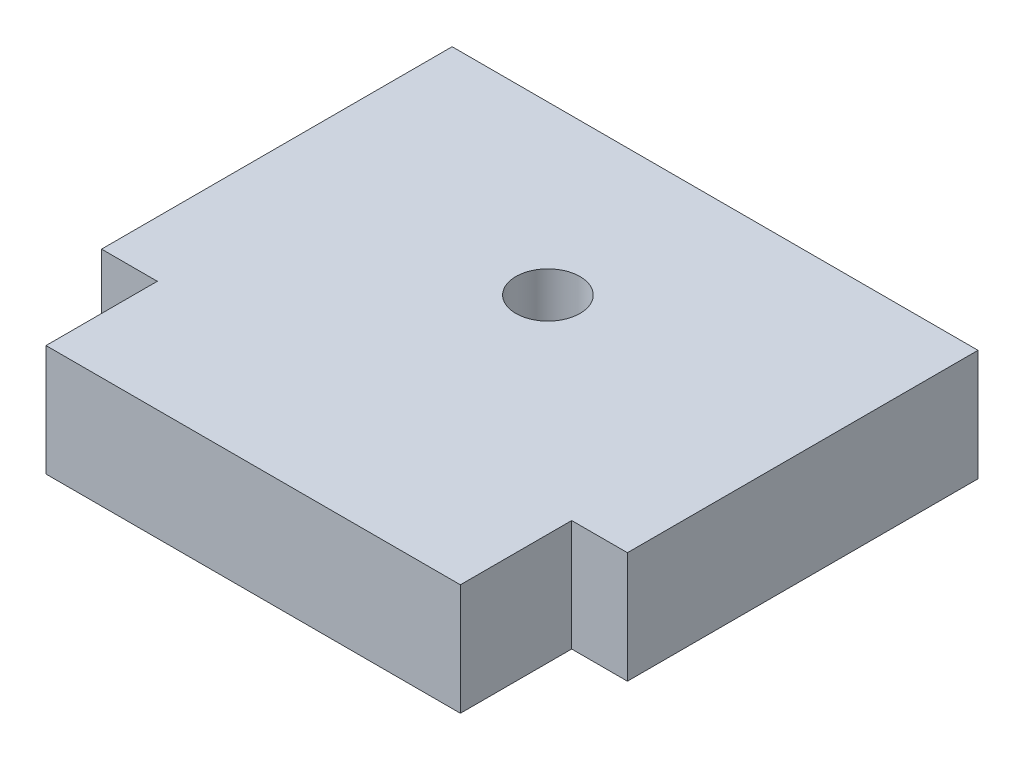
ISO-10303-21;
HEADER;
FILE_DESCRIPTION(('STEP AP214'),'2;1');
FILE_NAME('part.step','',(''),(''),'','','');
FILE_SCHEMA(('AUTOMOTIVE_DESIGN { 1 0 10303 214 1 1 1 1 }'));
ENDSEC;
DATA;
#1=APPLICATION_CONTEXT('core data for automotive mechanical design processes');
#2=APPLICATION_PROTOCOL_DEFINITION('international standard','automotive_design',2000,#1);
#3=PRODUCT_CONTEXT('',#1,'mechanical');
#4=PRODUCT('Part','Part','',(#3));
#5=PRODUCT_RELATED_PRODUCT_CATEGORY('part','',(#4));
#6=PRODUCT_DEFINITION_FORMATION('','',#4);
#7=PRODUCT_DEFINITION_CONTEXT('part definition',#1,'design');
#8=PRODUCT_DEFINITION('design','',#6,#7);
#9=PRODUCT_DEFINITION_SHAPE('','',#8);
#10=(LENGTH_UNIT() NAMED_UNIT(*) SI_UNIT(.MILLI.,.METRE.));
#11=(NAMED_UNIT(*) PLANE_ANGLE_UNIT() SI_UNIT($,.RADIAN.));
#12=(NAMED_UNIT(*) SI_UNIT($,.STERADIAN.) SOLID_ANGLE_UNIT());
#13=UNCERTAINTY_MEASURE_WITH_UNIT(LENGTH_MEASURE(1.E-05),#10,'distance_accuracy_value','');
#14=(GEOMETRIC_REPRESENTATION_CONTEXT(3) GLOBAL_UNCERTAINTY_ASSIGNED_CONTEXT((#13)) GLOBAL_UNIT_ASSIGNED_CONTEXT((#10,
#11,#12)) REPRESENTATION_CONTEXT('',''));
#15=CARTESIAN_POINT('',(0.,0.,0.));
#16=DIRECTION('',(0.,0.,1.));
#17=DIRECTION('',(1.,0.,0.));
#18=AXIS2_PLACEMENT_3D('',#15,#16,#17);
#19=CARTESIAN_POINT('',(-15.,6.35,10.));
#20=DIRECTION('',(0.,0.,-1.));
#21=DIRECTION('',(-1.,0.,0.));
#22=AXIS2_PLACEMENT_3D('',#19,#20,#21);
#23=PLANE('',#22);
#24=DIRECTION('',(1.,0.,0.));
#25=VECTOR('',#24,1.);
#26=CARTESIAN_POINT('',(-15.,0.,10.));
#27=LINE('',#26,#25);
#28=CARTESIAN_POINT('',(-15.,0.,10.));
#29=VERTEX_POINT('',#28);
#30=CARTESIAN_POINT('',(-11.82,0.,10.));
#31=VERTEX_POINT('',#30);
#32=EDGE_CURVE('E129',#29,#31,#27,.T.);
#33=ORIENTED_EDGE('',*,*,#32,.T.);
#34=DIRECTION('',(0.,-1.,0.));
#35=VECTOR('',#34,1.);
#36=CARTESIAN_POINT('',(-11.82,6.35,10.));
#37=LINE('',#36,#35);
#38=CARTESIAN_POINT('',(-11.82,6.35,10.));
#39=VERTEX_POINT('',#38);
#40=EDGE_CURVE('E11',#39,#31,#37,.T.);
#41=ORIENTED_EDGE('',*,*,#40,.F.);
#42=DIRECTION('',(1.,0.,0.));
#43=VECTOR('',#42,1.);
#44=CARTESIAN_POINT('',(-15.,6.35,10.));
#45=LINE('',#44,#43);
#46=CARTESIAN_POINT('',(-15.,6.35,10.));
#47=VERTEX_POINT('',#46);
#48=EDGE_CURVE('E144',#47,#39,#45,.T.);
#49=ORIENTED_EDGE('',*,*,#48,.F.);
#50=DIRECTION('',(0.,-1.,0.));
#51=VECTOR('',#50,1.);
#52=CARTESIAN_POINT('',(-15.,6.35,10.));
#53=LINE('',#52,#51);
#54=EDGE_CURVE('E125',#47,#29,#53,.T.);
#55=ORIENTED_EDGE('',*,*,#54,.T.);
#56=EDGE_LOOP('',(#33,#41,#49,#55));
#57=FACE_BOUND('',#56,.T.);
#58=ADVANCED_FACE('F33',(#57),#23,.F.);
#59=CARTESIAN_POINT('',(-11.82,6.35,16.35));
#60=DIRECTION('',(1.,0.,0.));
#61=DIRECTION('',(0.,0.,-1.));
#62=AXIS2_PLACEMENT_3D('',#59,#60,#61);
#63=PLANE('',#62);
#64=DIRECTION('',(0.,0.,1.));
#65=VECTOR('',#64,1.);
#66=CARTESIAN_POINT('',(-11.82,0.,16.35));
#67=LINE('',#66,#65);
#68=CARTESIAN_POINT('',(-11.82,0.,16.35));
#69=VERTEX_POINT('',#68);
#70=EDGE_CURVE('E132',#31,#69,#67,.T.);
#71=ORIENTED_EDGE('',*,*,#70,.T.);
#72=DIRECTION('',(0.,-1.,0.));
#73=VECTOR('',#72,1.);
#74=CARTESIAN_POINT('',(-11.82,6.35,16.35));
#75=LINE('',#74,#73);
#76=CARTESIAN_POINT('',(-11.82,6.35,16.35));
#77=VERTEX_POINT('',#76);
#78=EDGE_CURVE('E41',#77,#69,#75,.T.);
#79=ORIENTED_EDGE('',*,*,#78,.F.);
#80=DIRECTION('',(0.,0.,1.));
#81=VECTOR('',#80,1.);
#82=CARTESIAN_POINT('',(-11.82,6.35,16.35));
#83=LINE('',#82,#81);
#84=EDGE_CURVE('E92',#39,#77,#83,.T.);
#85=ORIENTED_EDGE('',*,*,#84,.F.);
#86=ORIENTED_EDGE('',*,*,#40,.T.);
#87=EDGE_LOOP('',(#71,#79,#85,#86));
#88=FACE_BOUND('',#87,.T.);
#89=ADVANCED_FACE('F197',(#88),#63,.F.);
#90=CARTESIAN_POINT('',(-11.82,6.35,16.35));
#91=DIRECTION('',(0.,0.,-1.));
#92=DIRECTION('',(-1.,0.,0.));
#93=AXIS2_PLACEMENT_3D('',#90,#91,#92);
#94=PLANE('',#93);
#95=DIRECTION('',(1.,0.,0.));
#96=VECTOR('',#95,1.);
#97=CARTESIAN_POINT('',(-11.82,0.,16.35));
#98=LINE('',#97,#96);
#99=CARTESIAN_POINT('',(11.82,0.,16.35));
#100=VERTEX_POINT('',#99);
#101=EDGE_CURVE('E135',#69,#100,#98,.T.);
#102=ORIENTED_EDGE('',*,*,#101,.T.);
#103=DIRECTION('',(0.,-1.,0.));
#104=VECTOR('',#103,1.);
#105=CARTESIAN_POINT('',(11.82,6.35,16.35));
#106=LINE('',#105,#104);
#107=CARTESIAN_POINT('',(11.82,6.35,16.35));
#108=VERTEX_POINT('',#107);
#109=EDGE_CURVE('E151',#108,#100,#106,.T.);
#110=ORIENTED_EDGE('',*,*,#109,.F.);
#111=DIRECTION('',(1.,0.,0.));
#112=VECTOR('',#111,1.);
#113=CARTESIAN_POINT('',(-11.82,6.35,16.35));
#114=LINE('',#113,#112);
#115=EDGE_CURVE('E159',#77,#108,#114,.T.);
#116=ORIENTED_EDGE('',*,*,#115,.F.);
#117=ORIENTED_EDGE('',*,*,#78,.T.);
#118=EDGE_LOOP('',(#102,#110,#116,#117));
#119=FACE_BOUND('',#118,.T.);
#120=ADVANCED_FACE('F157',(#119),#94,.F.);
#121=CARTESIAN_POINT('',(11.82,6.35,16.35));
#122=DIRECTION('',(-1.,0.,0.));
#123=DIRECTION('',(0.,0.,1.));
#124=AXIS2_PLACEMENT_3D('',#121,#122,#123);
#125=PLANE('',#124);
#126=DIRECTION('',(0.,0.,-1.));
#127=VECTOR('',#126,1.);
#128=CARTESIAN_POINT('',(11.82,0.,16.35));
#129=LINE('',#128,#127);
#130=CARTESIAN_POINT('',(11.82,0.,10.));
#131=VERTEX_POINT('',#130);
#132=EDGE_CURVE('E137',#100,#131,#129,.T.);
#133=ORIENTED_EDGE('',*,*,#132,.T.);
#134=DIRECTION('',(0.,-1.,0.));
#135=VECTOR('',#134,1.);
#136=CARTESIAN_POINT('',(11.82,6.35,10.));
#137=LINE('',#136,#135);
#138=CARTESIAN_POINT('',(11.82,6.35,10.));
#139=VERTEX_POINT('',#138);
#140=EDGE_CURVE('E148',#139,#131,#137,.T.);
#141=ORIENTED_EDGE('',*,*,#140,.F.);
#142=DIRECTION('',(0.,0.,-1.));
#143=VECTOR('',#142,1.);
#144=CARTESIAN_POINT('',(11.82,6.35,16.35));
#145=LINE('',#144,#143);
#146=EDGE_CURVE('E171',#108,#139,#145,.T.);
#147=ORIENTED_EDGE('',*,*,#146,.F.);
#148=ORIENTED_EDGE('',*,*,#109,.T.);
#149=EDGE_LOOP('',(#133,#141,#147,#148));
#150=FACE_BOUND('',#149,.T.);
#151=ADVANCED_FACE('F167',(#150),#125,.F.);
#152=CARTESIAN_POINT('',(11.82,6.35,10.));
#153=DIRECTION('',(0.,0.,-1.));
#154=DIRECTION('',(-1.,0.,0.));
#155=AXIS2_PLACEMENT_3D('',#152,#153,#154);
#156=PLANE('',#155);
#157=DIRECTION('',(1.,0.,0.));
#158=VECTOR('',#157,1.);
#159=CARTESIAN_POINT('',(11.82,0.,10.));
#160=LINE('',#159,#158);
#161=CARTESIAN_POINT('',(15.,0.,10.));
#162=VERTEX_POINT('',#161);
#163=EDGE_CURVE('E139',#131,#162,#160,.T.);
#164=ORIENTED_EDGE('',*,*,#163,.T.);
#165=DIRECTION('',(0.,-1.,0.));
#166=VECTOR('',#165,1.);
#167=CARTESIAN_POINT('',(15.,6.35,10.));
#168=LINE('',#167,#166);
#169=CARTESIAN_POINT('',(15.,6.35,10.));
#170=VERTEX_POINT('',#169);
#171=EDGE_CURVE('E120',#170,#162,#168,.T.);
#172=ORIENTED_EDGE('',*,*,#171,.F.);
#173=DIRECTION('',(1.,0.,0.));
#174=VECTOR('',#173,1.);
#175=CARTESIAN_POINT('',(11.82,6.35,10.));
#176=LINE('',#175,#174);
#177=EDGE_CURVE('E111',#139,#170,#176,.T.);
#178=ORIENTED_EDGE('',*,*,#177,.F.);
#179=ORIENTED_EDGE('',*,*,#140,.T.);
#180=EDGE_LOOP('',(#164,#172,#178,#179));
#181=FACE_BOUND('',#180,.T.);
#182=ADVANCED_FACE('F170',(#181),#156,.F.);
#183=CARTESIAN_POINT('',(15.,6.35,10.));
#184=DIRECTION('',(-1.,0.,0.));
#185=DIRECTION('',(0.,0.,1.));
#186=AXIS2_PLACEMENT_3D('',#183,#184,#185);
#187=PLANE('',#186);
#188=DIRECTION('',(0.,0.,-1.));
#189=VECTOR('',#188,1.);
#190=CARTESIAN_POINT('',(15.,0.,10.));
#191=LINE('',#190,#189);
#192=CARTESIAN_POINT('',(15.,0.,-10.));
#193=VERTEX_POINT('',#192);
#194=EDGE_CURVE('E119',#162,#193,#191,.T.);
#195=ORIENTED_EDGE('',*,*,#194,.T.);
#196=DIRECTION('',(0.,-1.,0.));
#197=VECTOR('',#196,1.);
#198=CARTESIAN_POINT('',(15.,6.35,-10.));
#199=LINE('',#198,#197);
#200=CARTESIAN_POINT('',(15.,6.35,-10.));
#201=VERTEX_POINT('',#200);
#202=EDGE_CURVE('E116',#201,#193,#199,.T.);
#203=ORIENTED_EDGE('',*,*,#202,.F.);
#204=DIRECTION('',(0.,0.,-1.));
#205=VECTOR('',#204,1.);
#206=CARTESIAN_POINT('',(15.,6.35,10.));
#207=LINE('',#206,#205);
#208=EDGE_CURVE('E105',#170,#201,#207,.T.);
#209=ORIENTED_EDGE('',*,*,#208,.F.);
#210=ORIENTED_EDGE('',*,*,#171,.T.);
#211=EDGE_LOOP('',(#195,#203,#209,#210));
#212=FACE_BOUND('',#211,.T.);
#213=ADVANCED_FACE('F117',(#212),#187,.F.);
#214=CARTESIAN_POINT('',(-15.,6.35,-10.));
#215=DIRECTION('',(0.,0.,1.));
#216=DIRECTION('',(1.,0.,0.));
#217=AXIS2_PLACEMENT_3D('',#214,#215,#216);
#218=PLANE('',#217);
#219=DIRECTION('',(-1.,0.,0.));
#220=VECTOR('',#219,1.);
#221=CARTESIAN_POINT('',(-15.,0.,-10.));
#222=LINE('',#221,#220);
#223=CARTESIAN_POINT('',(-15.,0.,-10.));
#224=VERTEX_POINT('',#223);
#225=EDGE_CURVE('E78',#193,#224,#222,.T.);
#226=ORIENTED_EDGE('',*,*,#225,.T.);
#227=DIRECTION('',(0.,-1.,0.));
#228=VECTOR('',#227,1.);
#229=CARTESIAN_POINT('',(-15.,6.35,-10.));
#230=LINE('',#229,#228);
#231=CARTESIAN_POINT('',(-15.,6.35,-10.));
#232=VERTEX_POINT('',#231);
#233=EDGE_CURVE('E121',#232,#224,#230,.T.);
#234=ORIENTED_EDGE('',*,*,#233,.F.);
#235=DIRECTION('',(-1.,0.,0.));
#236=VECTOR('',#235,1.);
#237=CARTESIAN_POINT('',(-15.,6.35,-10.));
#238=LINE('',#237,#236);
#239=EDGE_CURVE('E109',#201,#232,#238,.T.);
#240=ORIENTED_EDGE('',*,*,#239,.F.);
#241=ORIENTED_EDGE('',*,*,#202,.T.);
#242=EDGE_LOOP('',(#226,#234,#240,#241));
#243=FACE_BOUND('',#242,.T.);
#244=ADVANCED_FACE('F123',(#243),#218,.F.);
#245=CARTESIAN_POINT('',(-15.,6.35,10.));
#246=DIRECTION('',(1.,0.,0.));
#247=DIRECTION('',(0.,0.,-1.));
#248=AXIS2_PLACEMENT_3D('',#245,#246,#247);
#249=PLANE('',#248);
#250=DIRECTION('',(0.,0.,1.));
#251=VECTOR('',#250,1.);
#252=CARTESIAN_POINT('',(-15.,0.,10.));
#253=LINE('',#252,#251);
#254=EDGE_CURVE('E84',#224,#29,#253,.T.);
#255=ORIENTED_EDGE('',*,*,#254,.T.);
#256=ORIENTED_EDGE('',*,*,#54,.F.);
#257=DIRECTION('',(0.,0.,1.));
#258=VECTOR('',#257,1.);
#259=CARTESIAN_POINT('',(-15.,6.35,10.));
#260=LINE('',#259,#258);
#261=EDGE_CURVE('E49',#232,#47,#260,.T.);
#262=ORIENTED_EDGE('',*,*,#261,.F.);
#263=ORIENTED_EDGE('',*,*,#233,.T.);
#264=EDGE_LOOP('',(#255,#256,#262,#263));
#265=FACE_BOUND('',#264,.T.);
#266=ADVANCED_FACE('F186',(#265),#249,.F.);
#267=CARTESIAN_POINT('',(0.,6.35,0.));
#268=DIRECTION('',(0.,1.,0.));
#269=DIRECTION('',(0.,0.,1.));
#270=AXIS2_PLACEMENT_3D('',#267,#268,#269);
#271=PLANE('',#270);
#272=CARTESIAN_POINT('',(0.,6.35,-0.4648));
#273=DIRECTION('',(0.,1.,0.));
#274=DIRECTION('',(0.,0.,1.));
#275=AXIS2_PLACEMENT_3D('',#272,#273,#274);
#276=CIRCLE('',#275,1.82879999999999);
#277=CARTESIAN_POINT('',(0.,6.35,1.36399999999999));
#278=VERTEX_POINT('',#277);
#279=EDGE_CURVE('E179',#278,#278,#276,.T.);
#280=ORIENTED_EDGE('',*,*,#279,.F.);
#281=EDGE_LOOP('',(#280));
#282=FACE_BOUND('',#281,.T.);
#283=ORIENTED_EDGE('',*,*,#48,.T.);
#284=ORIENTED_EDGE('',*,*,#84,.T.);
#285=ORIENTED_EDGE('',*,*,#115,.T.);
#286=ORIENTED_EDGE('',*,*,#146,.T.);
#287=ORIENTED_EDGE('',*,*,#177,.T.);
#288=ORIENTED_EDGE('',*,*,#208,.T.);
#289=ORIENTED_EDGE('',*,*,#239,.T.);
#290=ORIENTED_EDGE('',*,*,#261,.T.);
#291=EDGE_LOOP('',(#283,#284,#285,#286,#287,#288,#289,#290));
#292=FACE_BOUND('',#291,.T.);
#293=ADVANCED_FACE('F107',(#282,#292),#271,.T.);
#294=CARTESIAN_POINT('',(0.,0.,0.));
#295=DIRECTION('',(0.,1.,0.));
#296=DIRECTION('',(0.,0.,1.));
#297=AXIS2_PLACEMENT_3D('',#294,#295,#296);
#298=PLANE('',#297);
#299=CARTESIAN_POINT('',(0.,0.,-0.4648));
#300=DIRECTION('',(0.,1.,0.));
#301=DIRECTION('',(0.,0.,1.));
#302=AXIS2_PLACEMENT_3D('',#299,#300,#301);
#303=CIRCLE('',#302,1.8288);
#304=CARTESIAN_POINT('',(0.,0.,1.364));
#305=VERTEX_POINT('',#304);
#306=EDGE_CURVE('E133',#305,#305,#303,.T.);
#307=ORIENTED_EDGE('',*,*,#306,.T.);
#308=EDGE_LOOP('',(#307));
#309=FACE_BOUND('',#308,.T.);
#310=ORIENTED_EDGE('',*,*,#32,.F.);
#311=ORIENTED_EDGE('',*,*,#254,.F.);
#312=ORIENTED_EDGE('',*,*,#225,.F.);
#313=ORIENTED_EDGE('',*,*,#194,.F.);
#314=ORIENTED_EDGE('',*,*,#163,.F.);
#315=ORIENTED_EDGE('',*,*,#132,.F.);
#316=ORIENTED_EDGE('',*,*,#101,.F.);
#317=ORIENTED_EDGE('',*,*,#70,.F.);
#318=EDGE_LOOP('',(#310,#311,#312,#313,#314,#315,#316,#317));
#319=FACE_BOUND('',#318,.T.);
#320=ADVANCED_FACE('F163',(#309,#319),#298,.F.);
#321=CARTESIAN_POINT('',(0.,6.35,-0.4648));
#322=DIRECTION('',(0.,1.,0.));
#323=DIRECTION('',(0.,0.,1.));
#324=AXIS2_PLACEMENT_3D('',#321,#322,#323);
#325=CYLINDRICAL_SURFACE('',#324,1.82879999999999);
#326=ORIENTED_EDGE('',*,*,#306,.F.);
#327=EDGE_LOOP('',(#326));
#328=FACE_BOUND('',#327,.T.);
#329=ORIENTED_EDGE('',*,*,#279,.T.);
#330=EDGE_LOOP('',(#329));
#331=FACE_BOUND('',#330,.T.);
#332=ADVANCED_FACE('F183',(#328,#331),#325,.F.);
#333=CLOSED_SHELL('',(#58,#89,#120,#151,#182,#213,#244,#266,#293,#320,#332));
#334=MANIFOLD_SOLID_BREP('B2',#333);
#335=ADVANCED_BREP_SHAPE_REPRESENTATION('',(#18,#334),#14);
#336=SHAPE_DEFINITION_REPRESENTATION(#9,#335);
ENDSEC;
END-ISO-10303-21;
